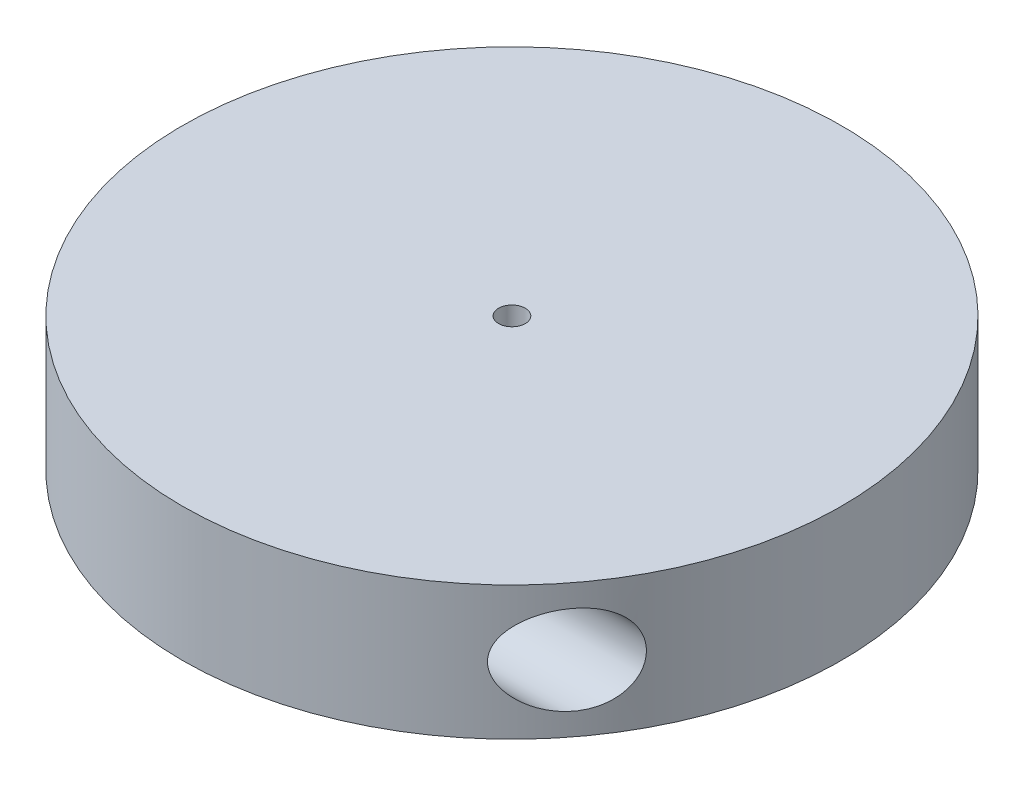
ISO-10303-21;
HEADER;
FILE_DESCRIPTION(('STEP AP214'),'2;1');
FILE_NAME('part.step','',(''),(''),'','','');
FILE_SCHEMA(('AUTOMOTIVE_DESIGN { 1 0 10303 214 1 1 1 1 }'));
ENDSEC;
DATA;
#1=APPLICATION_CONTEXT('core data for automotive mechanical design processes');
#2=APPLICATION_PROTOCOL_DEFINITION('international standard','automotive_design',2000,#1);
#3=PRODUCT_CONTEXT('',#1,'mechanical');
#4=PRODUCT('Part','Part','',(#3));
#5=PRODUCT_RELATED_PRODUCT_CATEGORY('part','',(#4));
#6=PRODUCT_DEFINITION_FORMATION('','',#4);
#7=PRODUCT_DEFINITION_CONTEXT('part definition',#1,'design');
#8=PRODUCT_DEFINITION('design','',#6,#7);
#9=PRODUCT_DEFINITION_SHAPE('','',#8);
#10=(LENGTH_UNIT() NAMED_UNIT(*) SI_UNIT(.MILLI.,.METRE.));
#11=(NAMED_UNIT(*) PLANE_ANGLE_UNIT() SI_UNIT($,.RADIAN.));
#12=(NAMED_UNIT(*) SI_UNIT($,.STERADIAN.) SOLID_ANGLE_UNIT());
#13=UNCERTAINTY_MEASURE_WITH_UNIT(LENGTH_MEASURE(1.E-05),#10,'distance_accuracy_value','');
#14=(GEOMETRIC_REPRESENTATION_CONTEXT(3) GLOBAL_UNCERTAINTY_ASSIGNED_CONTEXT((#13)) GLOBAL_UNIT_ASSIGNED_CONTEXT((#10,
#11,#12)) REPRESENTATION_CONTEXT('',''));
#15=CARTESIAN_POINT('',(0.,0.,0.));
#16=DIRECTION('',(0.,0.,1.));
#17=DIRECTION('',(1.,0.,0.));
#18=AXIS2_PLACEMENT_3D('',#15,#16,#17);
#19=CARTESIAN_POINT('',(-9.61809881687059E-07,26.2500062987495,-2.94865101479244E-06));
#20=DIRECTION('',(0.,-1.,0.));
#21=DIRECTION('',(0.,0.,-1.));
#22=AXIS2_PLACEMENT_3D('',#19,#20,#21);
#23=CYLINDRICAL_SURFACE('',#22,55.5);
#24=CARTESIAN_POINT('',(-37.1306823452696,15.0000062987495,-41.250002948651));
#25=CARTESIAN_POINT('',(-37.130684994333,15.1647015768329,-41.2500008845346));
#26=CARTESIAN_POINT('',(-37.1367275366241,15.3294429449108,-41.2445639329434));
#27=CARTESIAN_POINT('',(-37.1607245190174,15.6574235878155,-41.2229440721995));
#28=CARTESIAN_POINT('',(-37.1786870413129,15.8206617672322,-41.2067538719344));
#29=CARTESIAN_POINT('',(-37.2260453786992,16.1444423143521,-41.163975463648));
#30=CARTESIAN_POINT('',(-37.2554657258583,16.3049781214606,-41.1373649442618));
#31=CARTESIAN_POINT('',(-37.3249475797667,16.6218296277469,-41.0743325674668));
#32=CARTESIAN_POINT('',(-37.3650147567036,16.778143029183,-41.0379054818974));
#33=CARTESIAN_POINT('',(-37.4543435591546,17.0839291189549,-40.9563923482676));
#34=CARTESIAN_POINT('',(-37.5035066928463,17.2334555161404,-40.9113989184742));
#35=CARTESIAN_POINT('',(-37.6102838664479,17.5267328509323,-40.8132590539262));
#36=CARTESIAN_POINT('',(-37.6679012364078,17.6704814841737,-40.7601094061284));
#37=CARTESIAN_POINT('',(-37.8518269144811,18.0921683952992,-40.5896225897188));
#38=CARTESIAN_POINT('',(-37.9892881196488,18.3608091150855,-40.4611757761109));
#39=CARTESIAN_POINT('',(-38.3614284142182,19.0004670361611,-40.1091621877515));
#40=CARTESIAN_POINT('',(-38.6101871800977,19.3548397181823,-39.8702831562528));
#41=CARTESIAN_POINT('',(-39.0065826607771,19.8420922281399,-39.4812838414426));
#42=CARTESIAN_POINT('',(-39.142830440174,19.997340735179,-39.346260141312));
#43=CARTESIAN_POINT('',(-39.4215198576952,20.2934553320874,-39.0670301186237));
#44=CARTESIAN_POINT('',(-39.563961427613,20.4343215802779,-38.9228238971762));
#45=CARTESIAN_POINT('',(-39.9022914514707,20.746985204633,-38.5763421437204));
#46=CARTESIAN_POINT('',(-40.1000285092398,20.9132293229784,-38.3708617866154));
#47=CARTESIAN_POINT('',(-40.5011274997895,21.2210706741753,-37.9472544131324));
#48=CARTESIAN_POINT('',(-40.704491204802,21.3626600366721,-37.7291233878895));
#49=CARTESIAN_POINT('',(-41.1146522258684,21.6214615286634,-37.281735611268));
#50=CARTESIAN_POINT('',(-41.3214509316488,21.7386635187058,-37.052474280944));
#51=CARTESIAN_POINT('',(-41.736502737037,21.9485629771223,-36.5843203290273));
#52=CARTESIAN_POINT('',(-41.9447556859014,22.0412629477251,-36.3454286937876));
#53=CARTESIAN_POINT('',(-42.3636178806355,22.2028073519906,-35.8563672486841));
#54=CARTESIAN_POINT('',(-42.5742252046933,22.2713501197182,-35.6060960667328));
#55=CARTESIAN_POINT('',(-42.9937344939949,22.382373871688,-35.098397681084));
#56=CARTESIAN_POINT('',(-43.2026363362891,22.4248529930657,-34.8409699672573));
#57=CARTESIAN_POINT('',(-43.6170759514396,22.4828362084906,-34.3207152933296));
#58=CARTESIAN_POINT('',(-43.8226160445594,22.498359759023,-34.0578923662476));
#59=CARTESIAN_POINT('',(-44.2289796762447,22.5014042022024,-33.5284792404068));
#60=CARTESIAN_POINT('',(-44.4298040755892,22.4889302461604,-33.261889743634));
#61=CARTESIAN_POINT('',(-44.7937991315738,22.4390818494974,-32.7695612522256));
#62=CARTESIAN_POINT('',(-44.9578833230976,22.405977936157,-32.5440605892371));
#63=CARTESIAN_POINT('',(-45.2806944692504,22.3183609479122,-32.0933913064669));
#64=CARTESIAN_POINT('',(-45.439422240242,22.2638511515899,-31.8682226411344));
#65=CARTESIAN_POINT('',(-45.7504173040521,22.1327544151214,-31.4201195809077));
#66=CARTESIAN_POINT('',(-45.9026897889634,22.0561856192802,-31.1971835049454));
#67=CARTESIAN_POINT('',(-46.1998628053884,21.8803240806321,-30.7553861807625));
#68=CARTESIAN_POINT('',(-46.3447644369637,21.7810347409824,-30.536524327595));
#69=CARTESIAN_POINT('',(-46.6034411427782,21.5771537370058,-30.1399443784425));
#70=CARTESIAN_POINT('',(-46.7184705424801,21.4759919567765,-29.9612772477716));
#71=CARTESIAN_POINT('',(-46.9419110659079,21.2572390217368,-29.6099740395043));
#72=CARTESIAN_POINT('',(-47.0503232439429,21.1396504940382,-29.4373370030295));
#73=CARTESIAN_POINT('',(-47.2598662253609,20.8880750964777,-29.0997385604068));
#74=CARTESIAN_POINT('',(-47.3609971060239,20.7540884006984,-28.9347770728011));
#75=CARTESIAN_POINT('',(-47.5553031807153,20.469967079053,-28.6143061849973));
#76=CARTESIAN_POINT('',(-47.6484782392242,20.3198321782169,-28.4587969458216));
#77=CARTESIAN_POINT('',(-47.82681953322,20.0028294466353,-28.15806054319));
#78=CARTESIAN_POINT('',(-47.9119255717983,19.8358525188257,-28.0129123984572));
#79=CARTESIAN_POINT('',(-48.0727213130545,19.4868931564065,-27.7360659708193));
#80=CARTESIAN_POINT('',(-48.148412115552,19.3049124785633,-27.6043661173048));
#81=CARTESIAN_POINT('',(-48.289741060597,18.9271696134339,-27.3563801588024));
#82=CARTESIAN_POINT('',(-48.3553833882675,18.7314132135044,-27.2400876394918));
#83=CARTESIAN_POINT('',(-48.4760869741529,18.3275683014593,-27.0247016812399));
#84=CARTESIAN_POINT('',(-48.5311498644731,18.1194816980335,-26.9256055896092));
#85=CARTESIAN_POINT('',(-48.6240672165718,17.7193055197382,-26.7573988152773));
#86=CARTESIAN_POINT('',(-48.6632090726369,17.5284338211762,-26.6860933447618));
#87=CARTESIAN_POINT('',(-48.7327390224208,17.1400774426002,-26.5589092131476));
#88=CARTESIAN_POINT('',(-48.7631281338854,16.9425935344195,-26.5030287585006));
#89=CARTESIAN_POINT('',(-48.8149292299709,16.5426830438978,-26.4074968536746));
#90=CARTESIAN_POINT('',(-48.8363453992271,16.3402588122502,-26.367837838645));
#91=CARTESIAN_POINT('',(-48.8700681384827,15.9320885585296,-26.3052838721852));
#92=CARTESIAN_POINT('',(-48.8823752011243,15.7263427167122,-26.282388014164));
#93=CARTESIAN_POINT('',(-48.8971429453107,15.3307569402273,-26.2549018910263));
#94=CARTESIAN_POINT('',(-48.9003465389372,15.1410390474236,-26.2489305747654));
#95=CARTESIAN_POINT('',(-48.8990260385202,14.7617267634926,-26.2513905570842));
#96=CARTESIAN_POINT('',(-48.8945022714164,14.5721323674798,-26.2598212463245));
#97=CARTESIAN_POINT('',(-48.8777561819,14.1945058367713,-26.2909777286486));
#98=CARTESIAN_POINT('',(-48.8655353975912,14.0064733975524,-26.3137006656951));
#99=CARTESIAN_POINT('',(-48.8334700224133,13.6332971517582,-26.3731604785858));
#100=CARTESIAN_POINT('',(-48.8136253692899,13.4481533687836,-26.4098974688648));
#101=CARTESIAN_POINT('',(-48.7668420494857,13.0852529684897,-26.4961832656378));
#102=CARTESIAN_POINT('',(-48.7400328214412,12.9074238692705,-26.5454980337522));
#103=CARTESIAN_POINT('',(-48.6793112537747,12.556919611074,-26.6566861531016));
#104=CARTESIAN_POINT('',(-48.645396559024,12.3842461826947,-26.7185636680865));
#105=CARTESIAN_POINT('',(-48.5706660076164,12.045201783652,-26.8541736638335));
#106=CARTESIAN_POINT('',(-48.5298512351196,11.8788298279022,-26.927904282113));
#107=CARTESIAN_POINT('',(-48.4415392141724,11.553291592375,-27.0864497775932));
#108=CARTESIAN_POINT('',(-48.3940414561358,11.3941258633062,-27.1712655000125));
#109=CARTESIAN_POINT('',(-48.2905486049736,11.0774906529296,-27.3547931979178));
#110=CARTESIAN_POINT('',(-48.2342857790535,10.9203556761001,-27.453931116171));
#111=CARTESIAN_POINT('',(-48.1151155002464,10.6155568465601,-27.6622542913323));
#112=CARTESIAN_POINT('',(-48.0522077655312,10.4678933959896,-27.7714399743676));
#113=CARTESIAN_POINT('',(-47.9200892973683,10.1826540729907,-27.9987960267311));
#114=CARTESIAN_POINT('',(-47.8508784282679,10.0450784177817,-28.1169665894181));
#115=CARTESIAN_POINT('',(-47.7064937781841,9.78044169162308,-28.3612562117217));
#116=CARTESIAN_POINT('',(-47.6313179035832,9.65338434468114,-28.487378058887));
#117=CARTESIAN_POINT('',(-47.4680835177441,9.39876362968374,-28.7586269128463));
#118=CARTESIAN_POINT('',(-47.3794778687142,9.27226729346117,-28.9044276063563));
#119=CARTESIAN_POINT('',(-47.1960863281763,9.03253484537407,-29.2029187975923));
#120=CARTESIAN_POINT('',(-47.1012981612509,8.91930365898375,-29.3556118255373));
#121=CARTESIAN_POINT('',(-46.8084088001982,8.59973508183063,-29.8220967151842));
#122=CARTESIAN_POINT('',(-46.6017073942471,8.41340616016349,-30.1444204229796));
#123=CARTESIAN_POINT('',(-46.1388804446542,8.07120615862307,-30.8489197186629));
#124=CARTESIAN_POINT('',(-45.8799038320483,7.92341031139116,-31.2330975655633));
#125=CARTESIAN_POINT('',(-45.3428817964552,7.69398956074216,-32.0077474589928));
#126=CARTESIAN_POINT('',(-45.0648265989987,7.61239885470191,-32.398222652268));
#127=CARTESIAN_POINT('',(-44.4452737106061,7.50290118429861,-33.244369853922));
#128=CARTESIAN_POINT('',(-44.1011323991819,7.48674842143134,-33.6996130257791));
#129=CARTESIAN_POINT('',(-43.4007870884715,7.53442714437478,-34.5969112532739));
#130=CARTESIAN_POINT('',(-43.0445721839259,7.59833292168882,-35.0389536691347));
#131=CARTESIAN_POINT('',(-42.478350192009,7.75889389054233,-35.720394276981));
#132=CARTESIAN_POINT('',(-42.2696450298432,7.83059323781599,-35.967066834357));
#133=CARTESIAN_POINT('',(-41.8522309756467,7.99890332849295,-36.4519303628235));
#134=CARTESIAN_POINT('',(-41.6435220898424,8.09551860069159,-36.6901197830257));
#135=CARTESIAN_POINT('',(-41.227831015832,8.31335530876727,-37.1566135521563));
#136=CARTESIAN_POINT('',(-41.0208491279907,8.43458093576134,-37.384916209334));
#137=CARTESIAN_POINT('',(-40.6106024620687,8.70161695839969,-37.8301574962031));
#138=CARTESIAN_POINT('',(-40.4073367386871,8.84742100266683,-38.0470990428166));
#139=CARTESIAN_POINT('',(-40.049023832535,9.13059362175895,-38.423672919496));
#140=CARTESIAN_POINT('',(-39.8928352948208,9.26327456675096,-38.5857543814522));
#141=CARTESIAN_POINT('',(-39.585603497696,9.54445543151135,-38.9008830910965));
#142=CARTESIAN_POINT('',(-39.4345603206418,9.69295560432513,-39.0539301942095));
#143=CARTESIAN_POINT('',(-39.1395300659847,10.0059328780787,-39.3496000012627));
#144=CARTESIAN_POINT('',(-38.9955331873389,10.1703867795881,-39.4922373288117));
#145=CARTESIAN_POINT('',(-38.7165556534018,10.5156959196678,-39.7657747694135));
#146=CARTESIAN_POINT('',(-38.5815718071055,10.6965452994856,-39.8966790421573));
#147=CARTESIAN_POINT('',(-38.2682497327784,11.1554297603375,-40.1977136550729));
#148=CARTESIAN_POINT('',(-38.0957321094602,11.4422096915852,-40.3610070009108));
#149=CARTESIAN_POINT('',(-37.861773907105,11.8971760802812,-40.5801423246749));
#150=CARTESIAN_POINT('',(-37.7879272954311,12.0529558510839,-40.6488838473981));
#151=CARTESIAN_POINT('',(-37.6498463537572,12.3725410209224,-40.7768096251399));
#152=CARTESIAN_POINT('',(-37.5856097734873,12.5363445291702,-40.8359961178068));
#153=CARTESIAN_POINT('',(-37.4792195573762,12.8399442754981,-40.9336367941883));
#154=CARTESIAN_POINT('',(-37.4351826442385,12.9785028972057,-40.9738982674409));
#155=CARTESIAN_POINT('',(-37.355241951761,13.2598979029358,-41.0467920728305));
#156=CARTESIAN_POINT('',(-37.3193362913916,13.402733288926,-41.0794261694899));
#157=CARTESIAN_POINT('',(-37.2564559684798,13.6916341779324,-41.1364632036569));
#158=CARTESIAN_POINT('',(-37.2294616575303,13.837691806778,-41.1608842521666));
#159=CARTESIAN_POINT('',(-37.1849194438466,14.1323571090988,-41.2011284905027));
#160=CARTESIAN_POINT('',(-37.1673665093061,14.2809633806026,-41.2169562601819));
#161=CARTESIAN_POINT('',(-37.146748335644,14.5248423593257,-41.2355369814796));
#162=CARTESIAN_POINT('',(-37.1407304460574,14.6196779418512,-41.2409564317));
#163=CARTESIAN_POINT('',(-37.1326962957957,14.80967261235,-41.2481903627208));
#164=CARTESIAN_POINT('',(-37.1306808144219,14.9048317597116,-41.250004141468));
#165=CARTESIAN_POINT('',(-37.1306823452696,15.0000062987495,-41.250002948651));
#166=B_SPLINE_CURVE_WITH_KNOTS('',3,(#24,#25,#26,#27,#28,#29,#30,#31,#32,#33,#34,#35,#36,#37,
#38,#39,#40,#41,#42,#43,#44,#45,#46,#47,#48,#49,#50,#51,#52,#53,#54,#55,#56,#57,#58,#59,#60,#61,
#62,#63,#64,#65,#66,#67,#68,#69,#70,#71,#72,#73,#74,#75,#76,#77,#78,#79,#80,#81,#82,#83,#84,#85,
#86,#87,#88,#89,#90,#91,#92,#93,#94,#95,#96,#97,#98,#99,#100,#101,#102,#103,#104,#105,#106,#107,
#108,#109,#110,#111,#112,#113,#114,#115,#116,#117,#118,#119,#120,#121,#122,#123,#124,#125,#126,
#127,#128,#129,#130,#131,#132,#133,#134,#135,#136,#137,#138,#139,#140,#141,#142,#143,#144,#145,
#146,#147,#148,#149,#150,#151,#152,#153,#154,#155,#156,#157,#158,#159,#160,#161,#162,#163,#164,
#165),.UNSPECIFIED.,.T.,.F.,(4,2,2,2,2,2,2,2,2,2,2,2,2,2,2,2,2,2,2,2,2,2,2,2,2,2,2,2,2,2,2,2,2,
2,2,2,2,2,2,2,2,2,2,2,2,2,2,2,2,2,2,2,2,2,2,2,2,2,2,2,2,2,2,2,2,2,2,2,2,2,4),(0.,
0.493968227439194,0.988271726541478,1.48363943725814,1.97927149681541,2.46982138963035,
2.9605650270607,3.94121411038913,5.41612910913074,6.15598814442326,6.89583903440556,
7.88477688775308,8.87402985594769,9.86369330416229,10.8532556455323,11.854770522522,
12.856356973117,13.8572201793334,14.8578992500483,15.6996091499622,16.5411901815968,
17.3820809499321,18.2228458492498,18.9281905225845,19.6334225197819,20.3386470309018,
21.0438835524142,21.7540241206582,22.4640816573807,23.1738426504922,23.8834940596616,
24.505109481227,25.1266525937983,25.7479055190307,26.3691248429589,26.9379496228277,
27.506750336684,28.0754374224888,28.6441291521247,29.2029260377198,29.761908432102,
30.3208030790569,30.8797403655718,31.4614953813957,32.0432750809172,32.6250673041586,
33.2070646377783,33.8435681905739,34.4803073390001,35.7532289052724,37.2067997057913,
38.6611208516904,40.3674830270099,42.0754298198457,43.067460428105,44.0596714781506,
45.052051642632,46.044175755413,46.8274074856328,47.6106517463597,48.3927736396054,
49.1746171431802,50.2872575079076,50.843521855234,51.3996557440184,51.8518085550833,
52.3038566610521,52.7549012949943,53.2057053047349,53.4911053946659,53.7765610488476),.UNSPECIFIED.);
#167=CARTESIAN_POINT('',(-37.1306823452696,15.0000062987495,-41.250002948651));
#168=VERTEX_POINT('',#167);
#169=EDGE_CURVE('E57',#168,#168,#166,.T.);
#170=ORIENTED_EDGE('',*,*,#169,.T.);
#171=EDGE_LOOP('',(#170));
#172=FACE_BOUND('',#171,.T.);
#173=CARTESIAN_POINT('',(-9.61809881687059E-07,26.2500062987495,-2.94865101479244E-06));
#174=DIRECTION('',(0.,1.,0.));
#175=DIRECTION('',(0.,0.,1.));
#176=AXIS2_PLACEMENT_3D('',#173,#174,#175);
#177=CIRCLE('',#176,55.5);
#178=CARTESIAN_POINT('',(-9.61809881687059E-07,26.2500062987495,55.499997051349));
#179=VERTEX_POINT('',#178);
#180=EDGE_CURVE('E10',#179,#179,#177,.T.);
#181=ORIENTED_EDGE('',*,*,#180,.F.);
#182=EDGE_LOOP('',(#181));
#183=FACE_BOUND('',#182,.T.);
#184=CARTESIAN_POINT('',(-9.61809881687059E-07,3.75000629874954,-2.94865101479244E-06));
#185=DIRECTION('',(0.,1.,0.));
#186=DIRECTION('',(0.,0.,1.));
#187=AXIS2_PLACEMENT_3D('',#184,#185,#186);
#188=CIRCLE('',#187,55.5);
#189=CARTESIAN_POINT('',(-9.61809881687059E-07,3.75000629874954,55.499997051349));
#190=VERTEX_POINT('',#189);
#191=EDGE_CURVE('E52',#190,#190,#188,.T.);
#192=ORIENTED_EDGE('',*,*,#191,.T.);
#193=EDGE_LOOP('',(#192));
#194=FACE_BOUND('',#193,.T.);
#195=CARTESIAN_POINT('',(37.1306804216498,15.0000062987495,41.249997051349));
#196=CARTESIAN_POINT('',(37.1306830707132,14.8353110206662,41.2499949872325));
#197=CARTESIAN_POINT('',(37.1367256130043,14.6705696525883,41.2445580356414));
#198=CARTESIAN_POINT('',(37.1607225953976,14.3425890096836,41.2229381748975));
#199=CARTESIAN_POINT('',(37.1786851176932,14.1793508302669,41.2067479746324));
#200=CARTESIAN_POINT('',(37.2260434550794,13.855570283147,41.163969566346));
#201=CARTESIAN_POINT('',(37.2554638022386,13.6950344760385,41.1373590469598));
#202=CARTESIAN_POINT('',(37.3249456561469,13.3781829697522,41.0743266701648));
#203=CARTESIAN_POINT('',(37.3650128330838,13.2218695683161,41.0378995845954));
#204=CARTESIAN_POINT('',(37.4543416355349,12.9160834785442,40.9563864509656));
#205=CARTESIAN_POINT('',(37.5035047692265,12.7665570813587,40.9113930211722));
#206=CARTESIAN_POINT('',(37.6102819428282,12.4732797465668,40.8132531566241));
#207=CARTESIAN_POINT('',(37.667899312788,12.3295311133253,40.7601035088264));
#208=CARTESIAN_POINT('',(37.8518249908613,11.9078442021999,40.5896166924168));
#209=CARTESIAN_POINT('',(37.989286196029,11.6392034824136,40.4611698788089));
#210=CARTESIAN_POINT('',(38.3614264905984,10.999545561338,40.1091562904495));
#211=CARTESIAN_POINT('',(38.6101852564779,10.6451728793168,39.8702772589508));
#212=CARTESIAN_POINT('',(39.0065807371573,10.1579203693592,39.4812779441406));
#213=CARTESIAN_POINT('',(39.1428285165543,10.0026718623201,39.34625424401));
#214=CARTESIAN_POINT('',(39.4215179340754,9.70655726541168,39.0670242213216));
#215=CARTESIAN_POINT('',(39.5639595039932,9.56569101722121,38.9228179998742));
#216=CARTESIAN_POINT('',(39.902289527851,9.25302739286611,38.5763362464184));
#217=CARTESIAN_POINT('',(40.1000265856201,9.08678327452072,38.3708558893134));
#218=CARTESIAN_POINT('',(40.5011255761698,8.77894192332373,37.9472485158303));
#219=CARTESIAN_POINT('',(40.7044892811822,8.63735256082696,37.7291174905875));
#220=CARTESIAN_POINT('',(41.1146503022487,8.37855106883563,37.281729713966));
#221=CARTESIAN_POINT('',(41.321449008029,8.26134907879328,37.052468383642));
#222=CARTESIAN_POINT('',(41.7365008134172,8.0514496203768,36.5843144317252));
#223=CARTESIAN_POINT('',(41.9447537622816,7.95874964977402,36.3454227964855));
#224=CARTESIAN_POINT('',(42.3636159570158,7.79720524550848,35.8563613513821));
#225=CARTESIAN_POINT('',(42.5742232810735,7.72866247778083,35.6060901694308));
#226=CARTESIAN_POINT('',(42.9937325703752,7.61763872581107,35.098391783782));
#227=CARTESIAN_POINT('',(43.2026344126693,7.57515960443335,34.8409640699552));
#228=CARTESIAN_POINT('',(43.6170740278198,7.51717638900847,34.3207093960275));
#229=CARTESIAN_POINT('',(43.8226141209396,7.50165283847607,34.0578864689456));
#230=CARTESIAN_POINT('',(44.2289777526249,7.49860839529665,33.5284733431048));
#231=CARTESIAN_POINT('',(44.4298021519694,7.5110823513387,33.261883846332));
#232=CARTESIAN_POINT('',(44.793797207954,7.56093074800165,32.7695553549236));
#233=CARTESIAN_POINT('',(44.9578813994778,7.59403466134212,32.544054691935));
#234=CARTESIAN_POINT('',(45.2806925456306,7.6816516495869,32.0933854091649));
#235=CARTESIAN_POINT('',(45.4394203166223,7.73616144590918,31.8682167438324));
#236=CARTESIAN_POINT('',(45.7504153804324,7.86725818237773,31.4201136836057));
#237=CARTESIAN_POINT('',(45.9026878653437,7.94382697821891,31.1971776076434));
#238=CARTESIAN_POINT('',(46.1998608817686,8.11968851686702,30.7553802834605));
#239=CARTESIAN_POINT('',(46.3447625133439,8.21897785651672,30.536518430293));
#240=CARTESIAN_POINT('',(46.6034392191584,8.42285886049324,30.1399384811405));
#241=CARTESIAN_POINT('',(46.7184686188603,8.52402064072258,29.9612713504696));
#242=CARTESIAN_POINT('',(46.9419091422881,8.74277357576233,29.6099681422023));
#243=CARTESIAN_POINT('',(47.0503213203231,8.8603621034609,29.4373311057275));
#244=CARTESIAN_POINT('',(47.2598643017412,9.11193750102136,29.0997326631048));
#245=CARTESIAN_POINT('',(47.3609951824042,9.24592419680067,28.9347711754991));
#246=CARTESIAN_POINT('',(47.5553012570955,9.5300455184461,28.6143002876952));
#247=CARTESIAN_POINT('',(47.6484763156044,9.68018041928221,28.4587910485195));
#248=CARTESIAN_POINT('',(47.8268176096002,9.99718315086378,28.158054645888));
#249=CARTESIAN_POINT('',(47.9119236481785,10.1641600786734,28.0129065011552));
#250=CARTESIAN_POINT('',(48.0727193894348,10.5131194410926,27.7360600735172));
#251=CARTESIAN_POINT('',(48.1484101919322,10.6951001189358,27.6043602200028));
#252=CARTESIAN_POINT('',(48.2897391369773,11.0728429840651,27.3563742615004));
#253=CARTESIAN_POINT('',(48.3553814646477,11.2685993839947,27.2400817421898));
#254=CARTESIAN_POINT('',(48.4760850505331,11.6724442960398,27.0246957839379));
#255=CARTESIAN_POINT('',(48.5311479408534,11.8805308994656,26.9255996923072));
#256=CARTESIAN_POINT('',(48.6240652929521,12.2807070777609,26.7573929179752));
#257=CARTESIAN_POINT('',(48.6632071490171,12.4715787763229,26.6860874474597));
#258=CARTESIAN_POINT('',(48.732737098801,12.8599351548989,26.5589033158456));
#259=CARTESIAN_POINT('',(48.7631262102657,13.0574190630796,26.5030228611986));
#260=CARTESIAN_POINT('',(48.8149273063511,13.4573295536013,26.4074909563725));
#261=CARTESIAN_POINT('',(48.8363434756074,13.6597537852489,26.3678319413429));
#262=CARTESIAN_POINT('',(48.8700662148629,14.0679240389695,26.3052779748832));
#263=CARTESIAN_POINT('',(48.8823732775045,14.2736698807869,26.282382116862));
#264=CARTESIAN_POINT('',(48.897141021691,14.6692556572718,26.2548959937243));
#265=CARTESIAN_POINT('',(48.9003446153175,14.8589735500755,26.2489246774634));
#266=CARTESIAN_POINT('',(48.8990241149005,15.2382858340065,26.2513846597822));
#267=CARTESIAN_POINT('',(48.8945003477966,15.4278802300193,26.2598153490224));
#268=CARTESIAN_POINT('',(48.8777542582802,15.8055067607278,26.2909718313466));
#269=CARTESIAN_POINT('',(48.8655334739714,15.9935391999467,26.313694768393));
#270=CARTESIAN_POINT('',(48.8334680987935,16.3667154457409,26.3731545812838));
#271=CARTESIAN_POINT('',(48.8136234456701,16.5518592287155,26.4098915715628));
#272=CARTESIAN_POINT('',(48.7668401258659,16.9147596290094,26.4961773683358));
#273=CARTESIAN_POINT('',(48.7400308978214,17.0925887282285,26.5454921364502));
#274=CARTESIAN_POINT('',(48.6793093301549,17.4430929864251,26.6566802557996));
#275=CARTESIAN_POINT('',(48.6453946354042,17.6157664148044,26.7185577707844));
#276=CARTESIAN_POINT('',(48.5706640839966,17.9548108138471,26.8541677665315));
#277=CARTESIAN_POINT('',(48.5298493114998,18.1211827695969,26.9278983848109));
#278=CARTESIAN_POINT('',(48.4415372905526,18.4467210051241,27.0864438802912));
#279=CARTESIAN_POINT('',(48.394039532516,18.6058867341929,27.1712596027105));
#280=CARTESIAN_POINT('',(48.2905466813539,18.9225219445695,27.3547873006158));
#281=CARTESIAN_POINT('',(48.2342838554338,19.079656921399,27.453925218869));
#282=CARTESIAN_POINT('',(48.1151135766267,19.384455750939,27.6622483940303));
#283=CARTESIAN_POINT('',(48.0522058419114,19.5321192015095,27.7714340770656));
#284=CARTESIAN_POINT('',(47.9200873737485,19.8173585245084,27.9987901294291));
#285=CARTESIAN_POINT('',(47.8508765046481,19.9549341797174,28.1169606921161));
#286=CARTESIAN_POINT('',(47.7064918545643,20.219570905876,28.3612503144197));
#287=CARTESIAN_POINT('',(47.6313159799634,20.346628252818,28.4873721615849));
#288=CARTESIAN_POINT('',(47.4680815941244,20.6012489678154,28.7586210155442));
#289=CARTESIAN_POINT('',(47.3794759450944,20.7277453040379,28.9044217090543));
#290=CARTESIAN_POINT('',(47.1960844045566,20.967477752125,29.2029129002903));
#291=CARTESIAN_POINT('',(47.1012962376311,21.0807089385153,29.3556059282353));
#292=CARTESIAN_POINT('',(46.8084068765784,21.4002775156685,29.8220908178822));
#293=CARTESIAN_POINT('',(46.6017054706274,21.5866064373356,30.1444145256776));
#294=CARTESIAN_POINT('',(46.1388785210344,21.928806438876,30.8489138213609));
#295=CARTESIAN_POINT('',(45.8799019084286,22.0766022861079,31.2330916682613));
#296=CARTESIAN_POINT('',(45.3428798728355,22.3060230367569,32.0077415616908));
#297=CARTESIAN_POINT('',(45.0648246753789,22.3876137427972,32.398216754966));
#298=CARTESIAN_POINT('',(44.4452717869863,22.4971114132005,33.2443639566199));
#299=CARTESIAN_POINT('',(44.1011304755621,22.5132641760677,33.6996071284771));
#300=CARTESIAN_POINT('',(43.4007851648517,22.4655854531243,34.5969053559719));
#301=CARTESIAN_POINT('',(43.0445702603061,22.4016796758103,35.0389477718327));
#302=CARTESIAN_POINT('',(42.4783482683892,22.2411187069568,35.7203883796789));
#303=CARTESIAN_POINT('',(42.2696431062234,22.1694193596831,35.967060937055));
#304=CARTESIAN_POINT('',(41.8522290520269,22.0011092690061,36.4519244655214));
#305=CARTESIAN_POINT('',(41.6435201662226,21.9044939968075,36.6901138857236));
#306=CARTESIAN_POINT('',(41.2278290922122,21.6866572887318,37.1566076548543));
#307=CARTESIAN_POINT('',(41.0208472043709,21.5654316617377,37.3849103120319));
#308=CARTESIAN_POINT('',(40.6106005384489,21.2983956390994,37.8301515989011));
#309=CARTESIAN_POINT('',(40.4073348150673,21.1525915948322,38.0470931455146));
#310=CARTESIAN_POINT('',(40.0490219089152,20.8694189757401,38.423667022194));
#311=CARTESIAN_POINT('',(39.892833371201,20.7367380307481,38.5857484841502));
#312=CARTESIAN_POINT('',(39.5856015740762,20.4555571659877,38.9008771937945));
#313=CARTESIAN_POINT('',(39.434558397022,20.307056993174,39.0539242969075));
#314=CARTESIAN_POINT('',(39.1395281423649,19.9940797194204,39.3495941039607));
#315=CARTESIAN_POINT('',(38.9955312637191,19.829625817911,39.4922314315097));
#316=CARTESIAN_POINT('',(38.716553729782,19.4843166778313,39.7657688721115));
#317=CARTESIAN_POINT('',(38.5815698834857,19.3034672980135,39.8966731448553));
#318=CARTESIAN_POINT('',(38.2682478091586,18.8445828371616,40.1977077577708));
#319=CARTESIAN_POINT('',(38.0957301858404,18.5578029059139,40.3610011036088));
#320=CARTESIAN_POINT('',(37.8617719834852,18.1028365172179,40.5801364273729));
#321=CARTESIAN_POINT('',(37.7879253718114,17.9470567464152,40.6488779500961));
#322=CARTESIAN_POINT('',(37.6498444301374,17.6274715765767,40.7768037278379));
#323=CARTESIAN_POINT('',(37.5856078498676,17.4636680683289,40.8359902205048));
#324=CARTESIAN_POINT('',(37.4792176337564,17.160068322001,40.9336308968863));
#325=CARTESIAN_POINT('',(37.4351807206187,17.0215097002934,40.9738923701389));
#326=CARTESIAN_POINT('',(37.3552400281412,16.7401146945633,41.0467861755285));
#327=CARTESIAN_POINT('',(37.3193343677719,16.597279308573,41.0794202721879));
#328=CARTESIAN_POINT('',(37.25645404486,16.3083784195667,41.1364573063549));
#329=CARTESIAN_POINT('',(37.2294597339106,16.1623207907211,41.1608783548645));
#330=CARTESIAN_POINT('',(37.1849175202269,15.8676554884003,41.2011225932007));
#331=CARTESIAN_POINT('',(37.1673645856863,15.7190492168964,41.2169503628799));
#332=CARTESIAN_POINT('',(37.1467464120242,15.4751702381734,41.2355310841776));
#333=CARTESIAN_POINT('',(37.1407285224376,15.3803346556479,41.240950534398));
#334=CARTESIAN_POINT('',(37.132694372176,15.1903399851491,41.2481844654188));
#335=CARTESIAN_POINT('',(37.1306788908021,15.0951808377875,41.249998244166));
#336=CARTESIAN_POINT('',(37.1306804216498,15.0000062987495,41.249997051349));
#337=B_SPLINE_CURVE_WITH_KNOTS('',3,(#195,#196,#197,#198,#199,#200,#201,#202,#203,#204,#205,
#206,#207,#208,#209,#210,#211,#212,#213,#214,#215,#216,#217,#218,#219,#220,#221,#222,#223,#224,
#225,#226,#227,#228,#229,#230,#231,#232,#233,#234,#235,#236,#237,#238,#239,#240,#241,#242,#243,
#244,#245,#246,#247,#248,#249,#250,#251,#252,#253,#254,#255,#256,#257,#258,#259,#260,#261,#262,
#263,#264,#265,#266,#267,#268,#269,#270,#271,#272,#273,#274,#275,#276,#277,#278,#279,#280,#281,
#282,#283,#284,#285,#286,#287,#288,#289,#290,#291,#292,#293,#294,#295,#296,#297,#298,#299,#300,
#301,#302,#303,#304,#305,#306,#307,#308,#309,#310,#311,#312,#313,#314,#315,#316,#317,#318,#319,
#320,#321,#322,#323,#324,#325,#326,#327,#328,#329,#330,#331,#332,#333,#334,#335,#336),
.UNSPECIFIED.,.T.,.F.,(4,2,2,2,2,2,2,2,2,2,2,2,2,2,2,2,2,2,2,2,2,2,2,2,2,2,2,2,2,2,2,2,2,2,2,2,
2,2,2,2,2,2,2,2,2,2,2,2,2,2,2,2,2,2,2,2,2,2,2,2,2,2,2,2,2,2,2,2,2,2,4),(0.,0.493968227439197,
0.98827172654148,1.48363943725814,1.97927149681541,2.46982138963034,2.9605650270607,
3.94121411038913,5.41612910913073,6.15598814442328,6.89583903440558,7.8847768877531,
8.87402985594772,9.86369330416232,10.8532556455323,11.8547705225221,12.856356973117,
13.8572201793334,14.8578992500483,15.6996091499623,16.5411901815968,17.3820809499321,
18.2228458492498,18.9281905225846,19.6334225197819,20.3386470309018,21.0438835524143,
21.7540241206582,22.4640816573808,23.1738426504923,23.8834940596617,24.505109481227,
25.1266525937984,25.7479055190308,26.369124842959,26.9379496228277,27.5067503366841,
28.0754374224888,28.6441291521248,29.2029260377199,29.761908432102,30.320803079057,
30.8797403655718,31.4614953813957,32.0432750809172,32.6250673041586,33.2070646377783,
33.8435681905739,34.4803073390001,35.7532289052724,37.2067997057913,38.6611208516905,
40.3674830270099,42.0754298198458,43.067460428105,44.0596714781507,45.052051642632,
46.0441757554131,46.8274074856328,47.6106517463597,48.3927736396055,49.1746171431803,
50.2872575079077,50.8435218552341,51.3996557440185,51.8518085550834,52.3038566610522,
52.7549012949944,53.205705304735,53.491105394666,53.7765610488477),.UNSPECIFIED.);
#338=CARTESIAN_POINT('',(37.1306804216498,15.0000062987495,41.249997051349));
#339=VERTEX_POINT('',#338);
#340=EDGE_CURVE('E44',#339,#339,#337,.T.);
#341=ORIENTED_EDGE('',*,*,#340,.F.);
#342=EDGE_LOOP('',(#341));
#343=FACE_BOUND('',#342,.T.);
#344=ADVANCED_FACE('F40',(#172,#183,#194,#343),#23,.T.);
#345=CARTESIAN_POINT('',(-9.61809881687059E-07,26.2500062987495,-2.94865101479244E-06));
#346=DIRECTION('',(0.,1.,0.));
#347=DIRECTION('',(0.,0.,1.));
#348=AXIS2_PLACEMENT_3D('',#345,#346,#347);
#349=PLANE('',#348);
#350=CARTESIAN_POINT('',(-9.61809881687059E-07,26.2500062987495,-2.94865101479244E-06));
#351=DIRECTION('',(0.,1.,0.));
#352=DIRECTION('',(0.,0.,1.));
#353=AXIS2_PLACEMENT_3D('',#350,#351,#352);
#354=CIRCLE('',#353,2.25);
#355=CARTESIAN_POINT('',(-9.61809881687059E-07,26.2500062987495,2.24999705134899));
#356=VERTEX_POINT('',#355);
#357=EDGE_CURVE('E102',#356,#356,#354,.T.);
#358=ORIENTED_EDGE('',*,*,#357,.F.);
#359=EDGE_LOOP('',(#358));
#360=FACE_BOUND('',#359,.T.);
#361=ORIENTED_EDGE('',*,*,#180,.T.);
#362=EDGE_LOOP('',(#361));
#363=FACE_BOUND('',#362,.T.);
#364=ADVANCED_FACE('F75',(#360,#363),#349,.T.);
#365=CARTESIAN_POINT('',(-9.61809881687059E-07,3.75000629874954,-2.94865101479244E-06));
#366=DIRECTION('',(0.,1.,0.));
#367=DIRECTION('',(0.,0.,1.));
#368=AXIS2_PLACEMENT_3D('',#365,#366,#367);
#369=PLANE('',#368);
#370=CARTESIAN_POINT('',(-9.61809881687059E-07,3.75000629874954,-2.94865101479244E-06));
#371=DIRECTION('',(0.,1.,0.));
#372=DIRECTION('',(0.,0.,1.));
#373=AXIS2_PLACEMENT_3D('',#370,#371,#372);
#374=CIRCLE('',#373,2.25);
#375=CARTESIAN_POINT('',(-9.61809881687059E-07,3.75000629874954,2.24999705134899));
#376=VERTEX_POINT('',#375);
#377=EDGE_CURVE('E99',#376,#376,#374,.T.);
#378=ORIENTED_EDGE('',*,*,#377,.T.);
#379=EDGE_LOOP('',(#378));
#380=FACE_BOUND('',#379,.T.);
#381=ORIENTED_EDGE('',*,*,#191,.F.);
#382=EDGE_LOOP('',(#381));
#383=FACE_BOUND('',#382,.T.);
#384=ADVANCED_FACE('F73',(#380,#383),#369,.F.);
#385=CARTESIAN_POINT('',(-60.0000009618099,15.0000062987495,-33.750002948651));
#386=DIRECTION('',(1.,0.,0.));
#387=DIRECTION('',(0.,0.,-1.));
#388=AXIS2_PLACEMENT_3D('',#385,#386,#387);
#389=CYLINDRICAL_SURFACE('',#388,7.49999999999999);
#390=CARTESIAN_POINT('',(-9.61809881687059E-07,15.0000062987495,-33.750002948651));
#391=DIRECTION('',(1.,0.,0.));
#392=DIRECTION('',(0.,0.,-1.));
#393=AXIS2_PLACEMENT_3D('',#390,#391,#392);
#394=CIRCLE('',#393,7.49999999999999);
#395=CARTESIAN_POINT('',(-9.61809881687059E-07,15.0000062987495,-41.250002948651));
#396=VERTEX_POINT('',#395);
#397=EDGE_CURVE('E60',#396,#396,#394,.T.);
#398=ORIENTED_EDGE('',*,*,#397,.T.);
#399=EDGE_LOOP('',(#398));
#400=FACE_BOUND('',#399,.T.);
#401=ORIENTED_EDGE('',*,*,#169,.F.);
#402=EDGE_LOOP('',(#401));
#403=FACE_BOUND('',#402,.T.);
#404=ADVANCED_FACE('F67',(#400,#403),#389,.F.);
#405=CARTESIAN_POINT('',(-9.61809881687059E-07,15.0000062987495,-33.750002948651));
#406=DIRECTION('',(1.,0.,0.));
#407=DIRECTION('',(0.,0.,-1.));
#408=AXIS2_PLACEMENT_3D('',#405,#406,#407);
#409=PLANE('',#408);
#410=ORIENTED_EDGE('',*,*,#397,.F.);
#411=EDGE_LOOP('',(#410));
#412=FACE_BOUND('',#411,.T.);
#413=ADVANCED_FACE('F72',(#412),#409,.F.);
#414=CARTESIAN_POINT('',(59.9999990381901,15.0000062987495,33.749997051349));
#415=DIRECTION('',(-1.,0.,0.));
#416=DIRECTION('',(0.,0.,1.));
#417=AXIS2_PLACEMENT_3D('',#414,#415,#416);
#418=CYLINDRICAL_SURFACE('',#417,7.49999999999999);
#419=CARTESIAN_POINT('',(-9.61809881687059E-07,15.0000062987495,33.749997051349));
#420=DIRECTION('',(1.,0.,0.));
#421=DIRECTION('',(0.,0.,-1.));
#422=AXIS2_PLACEMENT_3D('',#419,#420,#421);
#423=CIRCLE('',#422,7.49999999999999);
#424=CARTESIAN_POINT('',(-9.61809881687059E-07,15.0000062987495,26.249997051349));
#425=VERTEX_POINT('',#424);
#426=EDGE_CURVE('E96',#425,#425,#423,.T.);
#427=ORIENTED_EDGE('',*,*,#426,.F.);
#428=EDGE_LOOP('',(#427));
#429=FACE_BOUND('',#428,.T.);
#430=ORIENTED_EDGE('',*,*,#340,.T.);
#431=EDGE_LOOP('',(#430));
#432=FACE_BOUND('',#431,.T.);
#433=ADVANCED_FACE('F116',(#429,#432),#418,.F.);
#434=CARTESIAN_POINT('',(-9.61809881687059E-07,15.0000062987495,33.749997051349));
#435=DIRECTION('',(1.,0.,0.));
#436=DIRECTION('',(0.,0.,-1.));
#437=AXIS2_PLACEMENT_3D('',#434,#435,#436);
#438=PLANE('',#437);
#439=ORIENTED_EDGE('',*,*,#426,.T.);
#440=EDGE_LOOP('',(#439));
#441=FACE_BOUND('',#440,.T.);
#442=ADVANCED_FACE('F110',(#441),#438,.T.);
#443=CARTESIAN_POINT('',(-9.61809881687059E-07,3.75000629874954,-2.94865101479244E-06));
#444=DIRECTION('',(0.,1.,0.));
#445=DIRECTION('',(0.,0.,1.));
#446=AXIS2_PLACEMENT_3D('',#443,#444,#445);
#447=CYLINDRICAL_SURFACE('',#446,2.25);
#448=ORIENTED_EDGE('',*,*,#377,.F.);
#449=EDGE_LOOP('',(#448));
#450=FACE_BOUND('',#449,.T.);
#451=ORIENTED_EDGE('',*,*,#357,.T.);
#452=EDGE_LOOP('',(#451));
#453=FACE_BOUND('',#452,.T.);
#454=ADVANCED_FACE('F108',(#450,#453),#447,.F.);
#455=CLOSED_SHELL('',(#344,#364,#384,#404,#413,#433,#442,#454));
#456=MANIFOLD_SOLID_BREP('B2',#455);
#457=ADVANCED_BREP_SHAPE_REPRESENTATION('',(#18,#456),#14);
#458=SHAPE_DEFINITION_REPRESENTATION(#9,#457);
ENDSEC;
END-ISO-10303-21;
